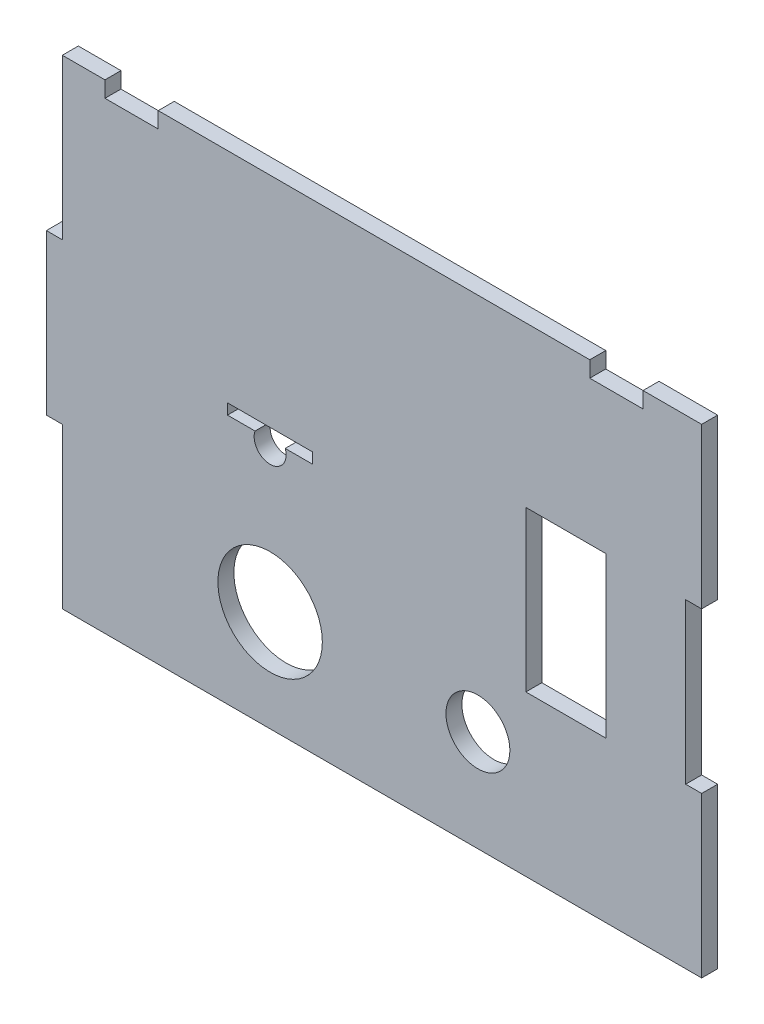
ISO-10303-21;
HEADER;
FILE_DESCRIPTION(('STEP AP214'),'2;1');
FILE_NAME('part.step','',(''),(''),'','','');
FILE_SCHEMA(('AUTOMOTIVE_DESIGN { 1 0 10303 214 1 1 1 1 }'));
ENDSEC;
DATA;
#1=APPLICATION_CONTEXT('core data for automotive mechanical design processes');
#2=APPLICATION_PROTOCOL_DEFINITION('international standard','automotive_design',2000,#1);
#3=PRODUCT_CONTEXT('',#1,'mechanical');
#4=PRODUCT('Part','Part','',(#3));
#5=PRODUCT_RELATED_PRODUCT_CATEGORY('part','',(#4));
#6=PRODUCT_DEFINITION_FORMATION('','',#4);
#7=PRODUCT_DEFINITION_CONTEXT('part definition',#1,'design');
#8=PRODUCT_DEFINITION('design','',#6,#7);
#9=PRODUCT_DEFINITION_SHAPE('','',#8);
#10=(LENGTH_UNIT() NAMED_UNIT(*) SI_UNIT(.MILLI.,.METRE.));
#11=(NAMED_UNIT(*) PLANE_ANGLE_UNIT() SI_UNIT($,.RADIAN.));
#12=(NAMED_UNIT(*) SI_UNIT($,.STERADIAN.) SOLID_ANGLE_UNIT());
#13=UNCERTAINTY_MEASURE_WITH_UNIT(LENGTH_MEASURE(1.E-05),#10,'distance_accuracy_value','');
#14=(GEOMETRIC_REPRESENTATION_CONTEXT(3) GLOBAL_UNCERTAINTY_ASSIGNED_CONTEXT((#13)) GLOBAL_UNIT_ASSIGNED_CONTEXT((#10,
#11,#12)) REPRESENTATION_CONTEXT('',''));
#15=CARTESIAN_POINT('',(0.,0.,0.));
#16=DIRECTION('',(0.,0.,1.));
#17=DIRECTION('',(1.,0.,0.));
#18=AXIS2_PLACEMENT_3D('',#15,#16,#17);
#19=CARTESIAN_POINT('',(0.,0.,3.));
#20=DIRECTION('',(0.,0.,1.));
#21=DIRECTION('',(1.,0.,0.));
#22=AXIS2_PLACEMENT_3D('',#19,#20,#21);
#23=PLANE('',#22);
#24=DIRECTION('',(-1.,0.,0.));
#25=VECTOR('',#24,1.);
#26=CARTESIAN_POINT('',(-175.191927583465,-27.0000000000001,3.));
#27=LINE('',#26,#25);
#28=CARTESIAN_POINT('',(-175.191927583465,-27.0000000000001,3.));
#29=VERTEX_POINT('',#28);
#30=CARTESIAN_POINT('',(-190.191927583465,-27.0000000000001,3.));
#31=VERTEX_POINT('',#30);
#32=EDGE_CURVE('E289',#29,#31,#27,.T.);
#33=ORIENTED_EDGE('',*,*,#32,.F.);
#34=DIRECTION('',(0.,1.,0.));
#35=VECTOR('',#34,1.);
#36=CARTESIAN_POINT('',(-175.191927583465,-57.0000000000001,3.));
#37=LINE('',#36,#35);
#38=CARTESIAN_POINT('',(-175.191927583465,-57.0000000000001,3.));
#39=VERTEX_POINT('',#38);
#40=EDGE_CURVE('E287',#39,#29,#37,.T.);
#41=ORIENTED_EDGE('',*,*,#40,.F.);
#42=DIRECTION('',(1.,0.,0.));
#43=VECTOR('',#42,1.);
#44=CARTESIAN_POINT('',(-175.191927583465,-57.0000000000001,3.));
#45=LINE('',#44,#43);
#46=CARTESIAN_POINT('',(-190.191927583465,-57.0000000000001,3.));
#47=VERTEX_POINT('',#46);
#48=EDGE_CURVE('E295',#47,#39,#45,.T.);
#49=ORIENTED_EDGE('',*,*,#48,.F.);
#50=DIRECTION('',(0.,-1.,0.));
#51=VECTOR('',#50,1.);
#52=CARTESIAN_POINT('',(-190.191927583465,-57.0000000000001,3.));
#53=LINE('',#52,#51);
#54=EDGE_CURVE('E292',#31,#47,#53,.T.);
#55=ORIENTED_EDGE('',*,*,#54,.F.);
#56=EDGE_LOOP('',(#33,#41,#49,#55));
#57=FACE_BOUND('',#56,.T.);
#58=CARTESIAN_POINT('',(-238.191927583464,-68.0000000000001,3.));
#59=DIRECTION('',(0.,0.,1.));
#60=DIRECTION('',(1.,0.,0.));
#61=AXIS2_PLACEMENT_3D('',#58,#59,#60);
#62=CIRCLE('',#61,9.79999999999999);
#63=CARTESIAN_POINT('',(-228.391927583464,-68.0000000000001,3.));
#64=VERTEX_POINT('',#63);
#65=EDGE_CURVE('E318',#64,#64,#62,.T.);
#66=ORIENTED_EDGE('',*,*,#65,.F.);
#67=EDGE_LOOP('',(#66));
#68=FACE_BOUND('',#67,.T.);
#69=DIRECTION('',(1.,0.,0.));
#70=VECTOR('',#69,1.);
#71=CARTESIAN_POINT('',(-157.191927583465,-27.0000000000001,3.));
#72=LINE('',#71,#70);
#73=CARTESIAN_POINT('',(-160.191927583465,-27.0000000000001,3.));
#74=VERTEX_POINT('',#73);
#75=CARTESIAN_POINT('',(-157.191927583465,-27.0000000000001,3.));
#76=VERTEX_POINT('',#75);
#77=EDGE_CURVE('E324',#74,#76,#72,.T.);
#78=ORIENTED_EDGE('',*,*,#77,.T.);
#79=DIRECTION('',(0.,1.,0.));
#80=VECTOR('',#79,1.);
#81=CARTESIAN_POINT('',(-157.191927583465,-27.0000000000001,3.));
#82=LINE('',#81,#80);
#83=CARTESIAN_POINT('',(-157.191927583465,3.,3.));
#84=VERTEX_POINT('',#83);
#85=EDGE_CURVE('E327',#76,#84,#82,.T.);
#86=ORIENTED_EDGE('',*,*,#85,.T.);
#87=DIRECTION('',(-1.,0.,0.));
#88=VECTOR('',#87,1.);
#89=CARTESIAN_POINT('',(-168.191927583465,3.,3.));
#90=LINE('',#89,#88);
#91=CARTESIAN_POINT('',(-168.191927583465,3.,3.));
#92=VERTEX_POINT('',#91);
#93=EDGE_CURVE('E330',#84,#92,#90,.T.);
#94=ORIENTED_EDGE('',*,*,#93,.T.);
#95=DIRECTION('',(0.,-1.,0.));
#96=VECTOR('',#95,1.);
#97=CARTESIAN_POINT('',(-168.191927583465,0.,3.));
#98=LINE('',#97,#96);
#99=CARTESIAN_POINT('',(-168.191927583465,0.,3.));
#100=VERTEX_POINT('',#99);
#101=EDGE_CURVE('E332',#92,#100,#98,.T.);
#102=ORIENTED_EDGE('',*,*,#101,.T.);
#103=DIRECTION('',(-1.,0.,0.));
#104=VECTOR('',#103,1.);
#105=CARTESIAN_POINT('',(-178.191927583465,0.,3.));
#106=LINE('',#105,#104);
#107=CARTESIAN_POINT('',(-178.191927583465,0.,3.));
#108=VERTEX_POINT('',#107);
#109=EDGE_CURVE('E334',#100,#108,#106,.T.);
#110=ORIENTED_EDGE('',*,*,#109,.T.);
#111=DIRECTION('',(0.,1.,0.));
#112=VECTOR('',#111,1.);
#113=CARTESIAN_POINT('',(-178.191927583465,3.,3.));
#114=LINE('',#113,#112);
#115=CARTESIAN_POINT('',(-178.191927583465,3.,3.));
#116=VERTEX_POINT('',#115);
#117=EDGE_CURVE('E336',#108,#116,#114,.T.);
#118=ORIENTED_EDGE('',*,*,#117,.T.);
#119=DIRECTION('',(-1.,0.,0.));
#120=VECTOR('',#119,1.);
#121=CARTESIAN_POINT('',(-259.191927583465,3.,3.));
#122=LINE('',#121,#120);
#123=CARTESIAN_POINT('',(-259.191927583465,3.,3.));
#124=VERTEX_POINT('',#123);
#125=EDGE_CURVE('E338',#116,#124,#122,.T.);
#126=ORIENTED_EDGE('',*,*,#125,.T.);
#127=DIRECTION('',(0.,-1.,0.));
#128=VECTOR('',#127,1.);
#129=CARTESIAN_POINT('',(-259.191927583465,0.,3.));
#130=LINE('',#129,#128);
#131=CARTESIAN_POINT('',(-259.191927583465,0.,3.));
#132=VERTEX_POINT('',#131);
#133=EDGE_CURVE('E340',#124,#132,#130,.T.);
#134=ORIENTED_EDGE('',*,*,#133,.T.);
#135=DIRECTION('',(-1.,0.,0.));
#136=VECTOR('',#135,1.);
#137=CARTESIAN_POINT('',(-269.191927583465,0.,3.));
#138=LINE('',#137,#136);
#139=CARTESIAN_POINT('',(-269.191927583465,0.,3.));
#140=VERTEX_POINT('',#139);
#141=EDGE_CURVE('E342',#132,#140,#138,.T.);
#142=ORIENTED_EDGE('',*,*,#141,.T.);
#143=DIRECTION('',(0.,1.,0.));
#144=VECTOR('',#143,1.);
#145=CARTESIAN_POINT('',(-269.191927583465,3.,3.));
#146=LINE('',#145,#144);
#147=CARTESIAN_POINT('',(-269.191927583465,3.,3.));
#148=VERTEX_POINT('',#147);
#149=EDGE_CURVE('E344',#140,#148,#146,.T.);
#150=ORIENTED_EDGE('',*,*,#149,.T.);
#151=DIRECTION('',(-1.,0.,0.));
#152=VECTOR('',#151,1.);
#153=CARTESIAN_POINT('',(-277.191927583465,3.,3.));
#154=LINE('',#153,#152);
#155=CARTESIAN_POINT('',(-277.191927583465,3.,3.));
#156=VERTEX_POINT('',#155);
#157=EDGE_CURVE('E346',#148,#156,#154,.T.);
#158=ORIENTED_EDGE('',*,*,#157,.T.);
#159=DIRECTION('',(0.,-1.,0.));
#160=VECTOR('',#159,1.);
#161=CARTESIAN_POINT('',(-277.191927583465,-27.0000000000001,3.));
#162=LINE('',#161,#160);
#163=CARTESIAN_POINT('',(-277.191927583465,-27.0000000000001,3.));
#164=VERTEX_POINT('',#163);
#165=EDGE_CURVE('E348',#156,#164,#162,.T.);
#166=ORIENTED_EDGE('',*,*,#165,.T.);
#167=DIRECTION('',(-1.,0.,0.));
#168=VECTOR('',#167,1.);
#169=CARTESIAN_POINT('',(-280.191927583465,-27.0000000000001,3.));
#170=LINE('',#169,#168);
#171=CARTESIAN_POINT('',(-280.191927583465,-27.0000000000001,3.));
#172=VERTEX_POINT('',#171);
#173=EDGE_CURVE('E350',#164,#172,#170,.T.);
#174=ORIENTED_EDGE('',*,*,#173,.T.);
#175=DIRECTION('',(0.,-1.,0.));
#176=VECTOR('',#175,1.);
#177=CARTESIAN_POINT('',(-280.191927583465,-57.0000000000001,3.));
#178=LINE('',#177,#176);
#179=CARTESIAN_POINT('',(-280.191927583465,-57.0000000000001,3.));
#180=VERTEX_POINT('',#179);
#181=EDGE_CURVE('E352',#172,#180,#178,.T.);
#182=ORIENTED_EDGE('',*,*,#181,.T.);
#183=DIRECTION('',(1.,0.,0.));
#184=VECTOR('',#183,1.);
#185=CARTESIAN_POINT('',(-277.191927583465,-57.0000000000001,3.));
#186=LINE('',#185,#184);
#187=CARTESIAN_POINT('',(-277.191927583465,-57.0000000000001,3.));
#188=VERTEX_POINT('',#187);
#189=EDGE_CURVE('E354',#180,#188,#186,.T.);
#190=ORIENTED_EDGE('',*,*,#189,.T.);
#191=DIRECTION('',(0.,-1.,0.));
#192=VECTOR('',#191,1.);
#193=CARTESIAN_POINT('',(-277.191927583464,-87.0000000000001,3.));
#194=LINE('',#193,#192);
#195=CARTESIAN_POINT('',(-277.191927583464,-87.0000000000001,3.));
#196=VERTEX_POINT('',#195);
#197=EDGE_CURVE('E356',#188,#196,#194,.T.);
#198=ORIENTED_EDGE('',*,*,#197,.T.);
#199=DIRECTION('',(1.,0.,0.));
#200=VECTOR('',#199,1.);
#201=CARTESIAN_POINT('',(-157.191927583464,-87.0000000000001,3.));
#202=LINE('',#201,#200);
#203=CARTESIAN_POINT('',(-157.191927583464,-87.0000000000001,3.));
#204=VERTEX_POINT('',#203);
#205=EDGE_CURVE('E358',#196,#204,#202,.T.);
#206=ORIENTED_EDGE('',*,*,#205,.T.);
#207=DIRECTION('',(0.,1.,0.));
#208=VECTOR('',#207,1.);
#209=CARTESIAN_POINT('',(-157.191927583465,-57.0000000000001,3.));
#210=LINE('',#209,#208);
#211=CARTESIAN_POINT('',(-157.191927583465,-57.0000000000001,3.));
#212=VERTEX_POINT('',#211);
#213=EDGE_CURVE('E360',#204,#212,#210,.T.);
#214=ORIENTED_EDGE('',*,*,#213,.T.);
#215=DIRECTION('',(-1.,0.,0.));
#216=VECTOR('',#215,1.);
#217=CARTESIAN_POINT('',(-160.191927583465,-57.0000000000001,3.));
#218=LINE('',#217,#216);
#219=CARTESIAN_POINT('',(-160.191927583465,-57.0000000000001,3.));
#220=VERTEX_POINT('',#219);
#221=EDGE_CURVE('E362',#212,#220,#218,.T.);
#222=ORIENTED_EDGE('',*,*,#221,.T.);
#223=DIRECTION('',(0.,1.,0.));
#224=VECTOR('',#223,1.);
#225=CARTESIAN_POINT('',(-160.191927583465,-27.0000000000001,3.));
#226=LINE('',#225,#224);
#227=EDGE_CURVE('E364',#220,#74,#226,.T.);
#228=ORIENTED_EDGE('',*,*,#227,.T.);
#229=EDGE_LOOP('',(#78,#86,#94,#102,#110,#118,#126,#134,#142,#150,#158,#166,#174,#182,#190,#198,
#206,#214,#222,#228));
#230=FACE_BOUND('',#229,.T.);
#231=CARTESIAN_POINT('',(-199.191927583464,-68.,3.));
#232=DIRECTION('',(0.,0.,1.));
#233=DIRECTION('',(1.,0.,0.));
#234=AXIS2_PLACEMENT_3D('',#231,#232,#233);
#235=CIRCLE('',#234,6.00000000000002);
#236=CARTESIAN_POINT('',(-193.191927583464,-68.,3.));
#237=VERTEX_POINT('',#236);
#238=EDGE_CURVE('E281',#237,#237,#235,.T.);
#239=ORIENTED_EDGE('',*,*,#238,.F.);
#240=EDGE_LOOP('',(#239));
#241=FACE_BOUND('',#240,.T.);
#242=DIRECTION('',(1.,0.,0.));
#243=VECTOR('',#242,1.);
#244=CARTESIAN_POINT('',(-246.191927583464,-40.0000000000001,3.));
#245=LINE('',#244,#243);
#246=CARTESIAN_POINT('',(-246.191927583464,-40.0000000000001,3.));
#247=VERTEX_POINT('',#246);
#248=CARTESIAN_POINT('',(-241.020354708211,-40.0000000000001,3.));
#249=VERTEX_POINT('',#248);
#250=EDGE_CURVE('E238',#247,#249,#245,.T.);
#251=ORIENTED_EDGE('',*,*,#250,.F.);
#252=DIRECTION('',(0.,-1.,0.));
#253=VECTOR('',#252,1.);
#254=CARTESIAN_POINT('',(-246.191927583464,-40.0000000000001,3.));
#255=LINE('',#254,#253);
#256=CARTESIAN_POINT('',(-246.191927583464,-38.0000000000001,3.));
#257=VERTEX_POINT('',#256);
#258=EDGE_CURVE('E230',#257,#247,#255,.T.);
#259=ORIENTED_EDGE('',*,*,#258,.F.);
#260=DIRECTION('',(-1.,0.,0.));
#261=VECTOR('',#260,1.);
#262=CARTESIAN_POINT('',(-246.191927583464,-38.0000000000001,3.));
#263=LINE('',#262,#261);
#264=CARTESIAN_POINT('',(-230.191927583464,-38.0000000000001,3.));
#265=VERTEX_POINT('',#264);
#266=EDGE_CURVE('E259',#265,#257,#263,.T.);
#267=ORIENTED_EDGE('',*,*,#266,.F.);
#268=DIRECTION('',(0.,1.,0.));
#269=VECTOR('',#268,1.);
#270=CARTESIAN_POINT('',(-230.191927583464,-40.0000000000001,3.));
#271=LINE('',#270,#269);
#272=CARTESIAN_POINT('',(-230.191927583464,-40.0000000000001,3.));
#273=VERTEX_POINT('',#272);
#274=EDGE_CURVE('E257',#273,#265,#271,.T.);
#275=ORIENTED_EDGE('',*,*,#274,.F.);
#276=DIRECTION('',(1.,0.,0.));
#277=VECTOR('',#276,1.);
#278=CARTESIAN_POINT('',(-235.363500458718,-40.0000000000001,3.));
#279=LINE('',#278,#277);
#280=CARTESIAN_POINT('',(-235.363500458718,-40.0000000000001,3.));
#281=VERTEX_POINT('',#280);
#282=EDGE_CURVE('E253',#281,#273,#279,.T.);
#283=ORIENTED_EDGE('',*,*,#282,.F.);
#284=CARTESIAN_POINT('',(-238.191927583464,-41.0000000000001,3.));
#285=DIRECTION('',(0.,0.,1.));
#286=DIRECTION('',(1.,0.,0.));
#287=AXIS2_PLACEMENT_3D('',#284,#285,#286);
#288=CIRCLE('',#287,2.99999999999995);
#289=EDGE_CURVE('E251',#249,#281,#288,.T.);
#290=ORIENTED_EDGE('',*,*,#289,.F.);
#291=EDGE_LOOP('',(#251,#259,#267,#275,#283,#290));
#292=FACE_BOUND('',#291,.T.);
#293=ADVANCED_FACE('F33',(#57,#68,#230,#241,#292),#23,.T.);
#294=CARTESIAN_POINT('',(0.,0.,0.));
#295=DIRECTION('',(0.,0.,1.));
#296=DIRECTION('',(1.,0.,0.));
#297=AXIS2_PLACEMENT_3D('',#294,#295,#296);
#298=PLANE('',#297);
#299=CARTESIAN_POINT('',(-199.191927583464,-68.,0.));
#300=DIRECTION('',(0.,0.,1.));
#301=DIRECTION('',(1.,0.,0.));
#302=AXIS2_PLACEMENT_3D('',#299,#300,#301);
#303=CIRCLE('',#302,6.00000000000002);
#304=CARTESIAN_POINT('',(-193.191927583464,-68.,0.));
#305=VERTEX_POINT('',#304);
#306=EDGE_CURVE('E246',#305,#305,#303,.T.);
#307=ORIENTED_EDGE('',*,*,#306,.T.);
#308=EDGE_LOOP('',(#307));
#309=FACE_BOUND('',#308,.T.);
#310=DIRECTION('',(0.,1.,0.));
#311=VECTOR('',#310,1.);
#312=CARTESIAN_POINT('',(-175.191927583465,-57.0000000000001,0.));
#313=LINE('',#312,#311);
#314=CARTESIAN_POINT('',(-175.191927583465,-57.0000000000001,0.));
#315=VERTEX_POINT('',#314);
#316=CARTESIAN_POINT('',(-175.191927583465,-27.0000000000001,0.));
#317=VERTEX_POINT('',#316);
#318=EDGE_CURVE('E284',#315,#317,#313,.T.);
#319=ORIENTED_EDGE('',*,*,#318,.T.);
#320=DIRECTION('',(-1.,0.,0.));
#321=VECTOR('',#320,1.);
#322=CARTESIAN_POINT('',(-175.191927583465,-27.0000000000001,0.));
#323=LINE('',#322,#321);
#324=CARTESIAN_POINT('',(-190.191927583465,-27.0000000000001,0.));
#325=VERTEX_POINT('',#324);
#326=EDGE_CURVE('E300',#317,#325,#323,.T.);
#327=ORIENTED_EDGE('',*,*,#326,.T.);
#328=DIRECTION('',(0.,-1.,0.));
#329=VECTOR('',#328,1.);
#330=CARTESIAN_POINT('',(-190.191927583465,-57.0000000000001,0.));
#331=LINE('',#330,#329);
#332=CARTESIAN_POINT('',(-190.191927583465,-57.0000000000001,0.));
#333=VERTEX_POINT('',#332);
#334=EDGE_CURVE('E303',#325,#333,#331,.T.);
#335=ORIENTED_EDGE('',*,*,#334,.T.);
#336=DIRECTION('',(1.,0.,0.));
#337=VECTOR('',#336,1.);
#338=CARTESIAN_POINT('',(-175.191927583465,-57.0000000000001,0.));
#339=LINE('',#338,#337);
#340=EDGE_CURVE('E290',#333,#315,#339,.T.);
#341=ORIENTED_EDGE('',*,*,#340,.T.);
#342=EDGE_LOOP('',(#319,#327,#335,#341));
#343=FACE_BOUND('',#342,.T.);
#344=DIRECTION('',(1.,0.,0.));
#345=VECTOR('',#344,1.);
#346=CARTESIAN_POINT('',(-157.191927583465,-27.0000000000001,0.));
#347=LINE('',#346,#345);
#348=CARTESIAN_POINT('',(-160.191927583465,-27.0000000000001,0.));
#349=VERTEX_POINT('',#348);
#350=CARTESIAN_POINT('',(-157.191927583465,-27.0000000000001,0.));
#351=VERTEX_POINT('',#350);
#352=EDGE_CURVE('E321',#349,#351,#347,.T.);
#353=ORIENTED_EDGE('',*,*,#352,.F.);
#354=DIRECTION('',(0.,1.,0.));
#355=VECTOR('',#354,1.);
#356=CARTESIAN_POINT('',(-160.191927583465,-27.0000000000001,0.));
#357=LINE('',#356,#355);
#358=CARTESIAN_POINT('',(-160.191927583465,-57.0000000000001,0.));
#359=VERTEX_POINT('',#358);
#360=EDGE_CURVE('E328',#359,#349,#357,.T.);
#361=ORIENTED_EDGE('',*,*,#360,.F.);
#362=DIRECTION('',(-1.,0.,0.));
#363=VECTOR('',#362,1.);
#364=CARTESIAN_POINT('',(-160.191927583465,-57.0000000000001,0.));
#365=LINE('',#364,#363);
#366=CARTESIAN_POINT('',(-157.191927583465,-57.0000000000001,0.));
#367=VERTEX_POINT('',#366);
#368=EDGE_CURVE('E403',#367,#359,#365,.T.);
#369=ORIENTED_EDGE('',*,*,#368,.F.);
#370=DIRECTION('',(0.,1.,0.));
#371=VECTOR('',#370,1.);
#372=CARTESIAN_POINT('',(-157.191927583465,-57.0000000000001,0.));
#373=LINE('',#372,#371);
#374=CARTESIAN_POINT('',(-157.191927583464,-87.0000000000001,0.));
#375=VERTEX_POINT('',#374);
#376=EDGE_CURVE('E401',#375,#367,#373,.T.);
#377=ORIENTED_EDGE('',*,*,#376,.F.);
#378=DIRECTION('',(1.,0.,0.));
#379=VECTOR('',#378,1.);
#380=CARTESIAN_POINT('',(-157.191927583464,-87.0000000000001,0.));
#381=LINE('',#380,#379);
#382=CARTESIAN_POINT('',(-277.191927583464,-87.0000000000001,0.));
#383=VERTEX_POINT('',#382);
#384=EDGE_CURVE('E399',#383,#375,#381,.T.);
#385=ORIENTED_EDGE('',*,*,#384,.F.);
#386=DIRECTION('',(0.,-1.,0.));
#387=VECTOR('',#386,1.);
#388=CARTESIAN_POINT('',(-277.191927583464,-87.0000000000001,0.));
#389=LINE('',#388,#387);
#390=CARTESIAN_POINT('',(-277.191927583465,-57.0000000000001,0.));
#391=VERTEX_POINT('',#390);
#392=EDGE_CURVE('E397',#391,#383,#389,.T.);
#393=ORIENTED_EDGE('',*,*,#392,.F.);
#394=DIRECTION('',(1.,0.,0.));
#395=VECTOR('',#394,1.);
#396=CARTESIAN_POINT('',(-277.191927583465,-57.0000000000001,0.));
#397=LINE('',#396,#395);
#398=CARTESIAN_POINT('',(-280.191927583465,-57.0000000000001,0.));
#399=VERTEX_POINT('',#398);
#400=EDGE_CURVE('E395',#399,#391,#397,.T.);
#401=ORIENTED_EDGE('',*,*,#400,.F.);
#402=DIRECTION('',(0.,-1.,0.));
#403=VECTOR('',#402,1.);
#404=CARTESIAN_POINT('',(-280.191927583465,-57.0000000000001,0.));
#405=LINE('',#404,#403);
#406=CARTESIAN_POINT('',(-280.191927583465,-27.0000000000001,0.));
#407=VERTEX_POINT('',#406);
#408=EDGE_CURVE('E393',#407,#399,#405,.T.);
#409=ORIENTED_EDGE('',*,*,#408,.F.);
#410=DIRECTION('',(-1.,0.,0.));
#411=VECTOR('',#410,1.);
#412=CARTESIAN_POINT('',(-280.191927583465,-27.0000000000001,0.));
#413=LINE('',#412,#411);
#414=CARTESIAN_POINT('',(-277.191927583465,-27.0000000000001,0.));
#415=VERTEX_POINT('',#414);
#416=EDGE_CURVE('E391',#415,#407,#413,.T.);
#417=ORIENTED_EDGE('',*,*,#416,.F.);
#418=DIRECTION('',(0.,-1.,0.));
#419=VECTOR('',#418,1.);
#420=CARTESIAN_POINT('',(-277.191927583465,-27.0000000000001,0.));
#421=LINE('',#420,#419);
#422=CARTESIAN_POINT('',(-277.191927583465,3.,0.));
#423=VERTEX_POINT('',#422);
#424=EDGE_CURVE('E389',#423,#415,#421,.T.);
#425=ORIENTED_EDGE('',*,*,#424,.F.);
#426=DIRECTION('',(-1.,0.,0.));
#427=VECTOR('',#426,1.);
#428=CARTESIAN_POINT('',(-277.191927583465,3.,0.));
#429=LINE('',#428,#427);
#430=CARTESIAN_POINT('',(-269.191927583465,3.,0.));
#431=VERTEX_POINT('',#430);
#432=EDGE_CURVE('E387',#431,#423,#429,.T.);
#433=ORIENTED_EDGE('',*,*,#432,.F.);
#434=DIRECTION('',(0.,1.,0.));
#435=VECTOR('',#434,1.);
#436=CARTESIAN_POINT('',(-269.191927583465,3.,0.));
#437=LINE('',#436,#435);
#438=CARTESIAN_POINT('',(-269.191927583465,0.,0.));
#439=VERTEX_POINT('',#438);
#440=EDGE_CURVE('E385',#439,#431,#437,.T.);
#441=ORIENTED_EDGE('',*,*,#440,.F.);
#442=DIRECTION('',(-1.,0.,0.));
#443=VECTOR('',#442,1.);
#444=CARTESIAN_POINT('',(-269.191927583465,0.,0.));
#445=LINE('',#444,#443);
#446=CARTESIAN_POINT('',(-259.191927583465,0.,0.));
#447=VERTEX_POINT('',#446);
#448=EDGE_CURVE('E383',#447,#439,#445,.T.);
#449=ORIENTED_EDGE('',*,*,#448,.F.);
#450=DIRECTION('',(0.,-1.,0.));
#451=VECTOR('',#450,1.);
#452=CARTESIAN_POINT('',(-259.191927583465,0.,0.));
#453=LINE('',#452,#451);
#454=CARTESIAN_POINT('',(-259.191927583465,3.,0.));
#455=VERTEX_POINT('',#454);
#456=EDGE_CURVE('E381',#455,#447,#453,.T.);
#457=ORIENTED_EDGE('',*,*,#456,.F.);
#458=DIRECTION('',(-1.,0.,0.));
#459=VECTOR('',#458,1.);
#460=CARTESIAN_POINT('',(-259.191927583465,3.,0.));
#461=LINE('',#460,#459);
#462=CARTESIAN_POINT('',(-178.191927583465,3.,0.));
#463=VERTEX_POINT('',#462);
#464=EDGE_CURVE('E379',#463,#455,#461,.T.);
#465=ORIENTED_EDGE('',*,*,#464,.F.);
#466=DIRECTION('',(0.,1.,0.));
#467=VECTOR('',#466,1.);
#468=CARTESIAN_POINT('',(-178.191927583465,3.,0.));
#469=LINE('',#468,#467);
#470=CARTESIAN_POINT('',(-178.191927583465,0.,0.));
#471=VERTEX_POINT('',#470);
#472=EDGE_CURVE('E377',#471,#463,#469,.T.);
#473=ORIENTED_EDGE('',*,*,#472,.F.);
#474=DIRECTION('',(-1.,0.,0.));
#475=VECTOR('',#474,1.);
#476=CARTESIAN_POINT('',(-178.191927583465,0.,0.));
#477=LINE('',#476,#475);
#478=CARTESIAN_POINT('',(-168.191927583465,0.,0.));
#479=VERTEX_POINT('',#478);
#480=EDGE_CURVE('E375',#479,#471,#477,.T.);
#481=ORIENTED_EDGE('',*,*,#480,.F.);
#482=DIRECTION('',(0.,-1.,0.));
#483=VECTOR('',#482,1.);
#484=CARTESIAN_POINT('',(-168.191927583465,0.,0.));
#485=LINE('',#484,#483);
#486=CARTESIAN_POINT('',(-168.191927583465,3.,0.));
#487=VERTEX_POINT('',#486);
#488=EDGE_CURVE('E373',#487,#479,#485,.T.);
#489=ORIENTED_EDGE('',*,*,#488,.F.);
#490=DIRECTION('',(-1.,0.,0.));
#491=VECTOR('',#490,1.);
#492=CARTESIAN_POINT('',(-168.191927583465,3.,0.));
#493=LINE('',#492,#491);
#494=CARTESIAN_POINT('',(-157.191927583465,3.,0.));
#495=VERTEX_POINT('',#494);
#496=EDGE_CURVE('E371',#495,#487,#493,.T.);
#497=ORIENTED_EDGE('',*,*,#496,.F.);
#498=DIRECTION('',(0.,1.,0.));
#499=VECTOR('',#498,1.);
#500=CARTESIAN_POINT('',(-157.191927583465,-27.0000000000001,0.));
#501=LINE('',#500,#499);
#502=EDGE_CURVE('E369',#351,#495,#501,.T.);
#503=ORIENTED_EDGE('',*,*,#502,.F.);
#504=EDGE_LOOP('',(#353,#361,#369,#377,#385,#393,#401,#409,#417,#425,#433,#441,#449,#457,#465,
#473,#481,#489,#497,#503));
#505=FACE_BOUND('',#504,.T.);
#506=CARTESIAN_POINT('',(-238.191927583464,-68.0000000000001,0.));
#507=DIRECTION('',(0.,0.,1.));
#508=DIRECTION('',(1.,0.,0.));
#509=AXIS2_PLACEMENT_3D('',#506,#507,#508);
#510=CIRCLE('',#509,9.79999999999999);
#511=CARTESIAN_POINT('',(-228.391927583464,-68.0000000000001,0.));
#512=VERTEX_POINT('',#511);
#513=EDGE_CURVE('E317',#512,#512,#510,.T.);
#514=ORIENTED_EDGE('',*,*,#513,.T.);
#515=EDGE_LOOP('',(#514));
#516=FACE_BOUND('',#515,.T.);
#517=DIRECTION('',(0.,-1.,0.));
#518=VECTOR('',#517,1.);
#519=CARTESIAN_POINT('',(-246.191927583464,-40.0000000000001,0.));
#520=LINE('',#519,#518);
#521=CARTESIAN_POINT('',(-246.191927583464,-38.0000000000001,0.));
#522=VERTEX_POINT('',#521);
#523=CARTESIAN_POINT('',(-246.191927583464,-40.0000000000001,0.));
#524=VERTEX_POINT('',#523);
#525=EDGE_CURVE('E56',#522,#524,#520,.T.);
#526=ORIENTED_EDGE('',*,*,#525,.T.);
#527=DIRECTION('',(1.,0.,0.));
#528=VECTOR('',#527,1.);
#529=CARTESIAN_POINT('',(-246.191927583464,-40.0000000000001,0.));
#530=LINE('',#529,#528);
#531=CARTESIAN_POINT('',(-241.020354708211,-40.0000000000001,0.));
#532=VERTEX_POINT('',#531);
#533=EDGE_CURVE('E245',#524,#532,#530,.T.);
#534=ORIENTED_EDGE('',*,*,#533,.T.);
#535=CARTESIAN_POINT('',(-238.191927583464,-41.0000000000001,0.));
#536=DIRECTION('',(0.,0.,1.));
#537=DIRECTION('',(1.,0.,0.));
#538=AXIS2_PLACEMENT_3D('',#535,#536,#537);
#539=CIRCLE('',#538,2.99999999999995);
#540=CARTESIAN_POINT('',(-235.363500458718,-40.0000000000001,0.));
#541=VERTEX_POINT('',#540);
#542=EDGE_CURVE('E263',#532,#541,#539,.T.);
#543=ORIENTED_EDGE('',*,*,#542,.T.);
#544=DIRECTION('',(1.,0.,0.));
#545=VECTOR('',#544,1.);
#546=CARTESIAN_POINT('',(-235.363500458718,-40.0000000000001,0.));
#547=LINE('',#546,#545);
#548=CARTESIAN_POINT('',(-230.191927583464,-40.0000000000001,0.));
#549=VERTEX_POINT('',#548);
#550=EDGE_CURVE('E266',#541,#549,#547,.T.);
#551=ORIENTED_EDGE('',*,*,#550,.T.);
#552=DIRECTION('',(0.,1.,0.));
#553=VECTOR('',#552,1.);
#554=CARTESIAN_POINT('',(-230.191927583464,-40.0000000000001,0.));
#555=LINE('',#554,#553);
#556=CARTESIAN_POINT('',(-230.191927583464,-38.0000000000001,0.));
#557=VERTEX_POINT('',#556);
#558=EDGE_CURVE('E269',#549,#557,#555,.T.);
#559=ORIENTED_EDGE('',*,*,#558,.T.);
#560=DIRECTION('',(-1.,0.,0.));
#561=VECTOR('',#560,1.);
#562=CARTESIAN_POINT('',(-246.191927583464,-38.0000000000001,0.));
#563=LINE('',#562,#561);
#564=EDGE_CURVE('E239',#557,#522,#563,.T.);
#565=ORIENTED_EDGE('',*,*,#564,.T.);
#566=EDGE_LOOP('',(#526,#534,#543,#551,#559,#565));
#567=FACE_BOUND('',#566,.T.);
#568=ADVANCED_FACE('F469',(#309,#343,#505,#516,#567),#298,.F.);
#569=CARTESIAN_POINT('',(-157.191927583465,-27.0000000000001,3.));
#570=DIRECTION('',(0.,1.,0.));
#571=DIRECTION('',(0.,0.,1.));
#572=AXIS2_PLACEMENT_3D('',#569,#570,#571);
#573=PLANE('',#572);
#574=ORIENTED_EDGE('',*,*,#352,.T.);
#575=DIRECTION('',(0.,0.,-1.));
#576=VECTOR('',#575,1.);
#577=CARTESIAN_POINT('',(-157.191927583465,-27.0000000000001,3.));
#578=LINE('',#577,#576);
#579=EDGE_CURVE('E11',#76,#351,#578,.T.);
#580=ORIENTED_EDGE('',*,*,#579,.F.);
#581=ORIENTED_EDGE('',*,*,#77,.F.);
#582=DIRECTION('',(0.,0.,-1.));
#583=VECTOR('',#582,1.);
#584=CARTESIAN_POINT('',(-160.191927583465,-27.0000000000001,3.));
#585=LINE('',#584,#583);
#586=EDGE_CURVE('E366',#74,#349,#585,.T.);
#587=ORIENTED_EDGE('',*,*,#586,.T.);
#588=EDGE_LOOP('',(#574,#580,#581,#587));
#589=FACE_BOUND('',#588,.T.);
#590=ADVANCED_FACE('F35',(#589),#573,.F.);
#591=CARTESIAN_POINT('',(-157.191927583465,-27.0000000000001,3.));
#592=DIRECTION('',(-1.,0.,0.));
#593=DIRECTION('',(0.,0.,1.));
#594=AXIS2_PLACEMENT_3D('',#591,#592,#593);
#595=PLANE('',#594);
#596=ORIENTED_EDGE('',*,*,#502,.T.);
#597=DIRECTION('',(0.,0.,-1.));
#598=VECTOR('',#597,1.);
#599=CARTESIAN_POINT('',(-157.191927583465,3.,3.));
#600=LINE('',#599,#598);
#601=EDGE_CURVE('E41',#84,#495,#600,.T.);
#602=ORIENTED_EDGE('',*,*,#601,.F.);
#603=ORIENTED_EDGE('',*,*,#85,.F.);
#604=ORIENTED_EDGE('',*,*,#579,.T.);
#605=EDGE_LOOP('',(#596,#602,#603,#604));
#606=FACE_BOUND('',#605,.T.);
#607=ADVANCED_FACE('F487',(#606),#595,.F.);
#608=CARTESIAN_POINT('',(-168.191927583465,3.,3.));
#609=DIRECTION('',(0.,-1.,0.));
#610=DIRECTION('',(0.,0.,-1.));
#611=AXIS2_PLACEMENT_3D('',#608,#609,#610);
#612=PLANE('',#611);
#613=ORIENTED_EDGE('',*,*,#496,.T.);
#614=DIRECTION('',(0.,0.,-1.));
#615=VECTOR('',#614,1.);
#616=CARTESIAN_POINT('',(-168.191927583465,3.,3.));
#617=LINE('',#616,#615);
#618=EDGE_CURVE('E456',#92,#487,#617,.T.);
#619=ORIENTED_EDGE('',*,*,#618,.F.);
#620=ORIENTED_EDGE('',*,*,#93,.F.);
#621=ORIENTED_EDGE('',*,*,#601,.T.);
#622=EDGE_LOOP('',(#613,#619,#620,#621));
#623=FACE_BOUND('',#622,.T.);
#624=ADVANCED_FACE('F463',(#623),#612,.F.);
#625=CARTESIAN_POINT('',(-168.191927583465,0.,3.));
#626=DIRECTION('',(1.,0.,0.));
#627=DIRECTION('',(0.,0.,-1.));
#628=AXIS2_PLACEMENT_3D('',#625,#626,#627);
#629=PLANE('',#628);
#630=ORIENTED_EDGE('',*,*,#488,.T.);
#631=DIRECTION('',(0.,0.,-1.));
#632=VECTOR('',#631,1.);
#633=CARTESIAN_POINT('',(-168.191927583465,0.,3.));
#634=LINE('',#633,#632);
#635=EDGE_CURVE('E453',#100,#479,#634,.T.);
#636=ORIENTED_EDGE('',*,*,#635,.F.);
#637=ORIENTED_EDGE('',*,*,#101,.F.);
#638=ORIENTED_EDGE('',*,*,#618,.T.);
#639=EDGE_LOOP('',(#630,#636,#637,#638));
#640=FACE_BOUND('',#639,.T.);
#641=ADVANCED_FACE('F475',(#640),#629,.F.);
#642=CARTESIAN_POINT('',(-178.191927583465,0.,3.));
#643=DIRECTION('',(0.,-1.,0.));
#644=DIRECTION('',(0.,0.,-1.));
#645=AXIS2_PLACEMENT_3D('',#642,#643,#644);
#646=PLANE('',#645);
#647=ORIENTED_EDGE('',*,*,#480,.T.);
#648=DIRECTION('',(0.,0.,-1.));
#649=VECTOR('',#648,1.);
#650=CARTESIAN_POINT('',(-178.191927583465,0.,3.));
#651=LINE('',#650,#649);
#652=EDGE_CURVE('E450',#108,#471,#651,.T.);
#653=ORIENTED_EDGE('',*,*,#652,.F.);
#654=ORIENTED_EDGE('',*,*,#109,.F.);
#655=ORIENTED_EDGE('',*,*,#635,.T.);
#656=EDGE_LOOP('',(#647,#653,#654,#655));
#657=FACE_BOUND('',#656,.T.);
#658=ADVANCED_FACE('F479',(#657),#646,.F.);
#659=CARTESIAN_POINT('',(-178.191927583465,3.,3.));
#660=DIRECTION('',(-1.,0.,0.));
#661=DIRECTION('',(0.,0.,1.));
#662=AXIS2_PLACEMENT_3D('',#659,#660,#661);
#663=PLANE('',#662);
#664=ORIENTED_EDGE('',*,*,#472,.T.);
#665=DIRECTION('',(0.,0.,-1.));
#666=VECTOR('',#665,1.);
#667=CARTESIAN_POINT('',(-178.191927583465,3.,3.));
#668=LINE('',#667,#666);
#669=EDGE_CURVE('E447',#116,#463,#668,.T.);
#670=ORIENTED_EDGE('',*,*,#669,.F.);
#671=ORIENTED_EDGE('',*,*,#117,.F.);
#672=ORIENTED_EDGE('',*,*,#652,.T.);
#673=EDGE_LOOP('',(#664,#670,#671,#672));
#674=FACE_BOUND('',#673,.T.);
#675=ADVANCED_FACE('F560',(#674),#663,.F.);
#676=CARTESIAN_POINT('',(-259.191927583465,3.,3.));
#677=DIRECTION('',(0.,-1.,0.));
#678=DIRECTION('',(1.,0.,0.));
#679=AXIS2_PLACEMENT_3D('',#676,#677,#678);
#680=PLANE('',#679);
#681=ORIENTED_EDGE('',*,*,#464,.T.);
#682=DIRECTION('',(0.,0.,-1.));
#683=VECTOR('',#682,1.);
#684=CARTESIAN_POINT('',(-259.191927583465,3.,3.));
#685=LINE('',#684,#683);
#686=EDGE_CURVE('E444',#124,#455,#685,.T.);
#687=ORIENTED_EDGE('',*,*,#686,.F.);
#688=ORIENTED_EDGE('',*,*,#125,.F.);
#689=ORIENTED_EDGE('',*,*,#669,.T.);
#690=EDGE_LOOP('',(#681,#687,#688,#689));
#691=FACE_BOUND('',#690,.T.);
#692=ADVANCED_FACE('F558',(#691),#680,.F.);
#693=CARTESIAN_POINT('',(-259.191927583465,0.,3.));
#694=DIRECTION('',(1.,0.,0.));
#695=DIRECTION('',(0.,0.,-1.));
#696=AXIS2_PLACEMENT_3D('',#693,#694,#695);
#697=PLANE('',#696);
#698=ORIENTED_EDGE('',*,*,#456,.T.);
#699=DIRECTION('',(0.,0.,-1.));
#700=VECTOR('',#699,1.);
#701=CARTESIAN_POINT('',(-259.191927583465,0.,3.));
#702=LINE('',#701,#700);
#703=EDGE_CURVE('E441',#132,#447,#702,.T.);
#704=ORIENTED_EDGE('',*,*,#703,.F.);
#705=ORIENTED_EDGE('',*,*,#133,.F.);
#706=ORIENTED_EDGE('',*,*,#686,.T.);
#707=EDGE_LOOP('',(#698,#704,#705,#706));
#708=FACE_BOUND('',#707,.T.);
#709=ADVANCED_FACE('F553',(#708),#697,.F.);
#710=CARTESIAN_POINT('',(-269.191927583465,0.,3.));
#711=DIRECTION('',(0.,-1.,0.));
#712=DIRECTION('',(0.,0.,-1.));
#713=AXIS2_PLACEMENT_3D('',#710,#711,#712);
#714=PLANE('',#713);
#715=ORIENTED_EDGE('',*,*,#448,.T.);
#716=DIRECTION('',(0.,0.,-1.));
#717=VECTOR('',#716,1.);
#718=CARTESIAN_POINT('',(-269.191927583465,0.,3.));
#719=LINE('',#718,#717);
#720=EDGE_CURVE('E438',#140,#439,#719,.T.);
#721=ORIENTED_EDGE('',*,*,#720,.F.);
#722=ORIENTED_EDGE('',*,*,#141,.F.);
#723=ORIENTED_EDGE('',*,*,#703,.T.);
#724=EDGE_LOOP('',(#715,#721,#722,#723));
#725=FACE_BOUND('',#724,.T.);
#726=ADVANCED_FACE('F548',(#725),#714,.F.);
#727=CARTESIAN_POINT('',(-269.191927583465,3.,3.));
#728=DIRECTION('',(-1.,0.,0.));
#729=DIRECTION('',(0.,0.,1.));
#730=AXIS2_PLACEMENT_3D('',#727,#728,#729);
#731=PLANE('',#730);
#732=ORIENTED_EDGE('',*,*,#440,.T.);
#733=DIRECTION('',(0.,0.,-1.));
#734=VECTOR('',#733,1.);
#735=CARTESIAN_POINT('',(-269.191927583465,3.,3.));
#736=LINE('',#735,#734);
#737=EDGE_CURVE('E435',#148,#431,#736,.T.);
#738=ORIENTED_EDGE('',*,*,#737,.F.);
#739=ORIENTED_EDGE('',*,*,#149,.F.);
#740=ORIENTED_EDGE('',*,*,#720,.T.);
#741=EDGE_LOOP('',(#732,#738,#739,#740));
#742=FACE_BOUND('',#741,.T.);
#743=ADVANCED_FACE('F544',(#742),#731,.F.);
#744=CARTESIAN_POINT('',(-277.191927583465,3.,3.));
#745=DIRECTION('',(0.,-1.,0.));
#746=DIRECTION('',(1.,0.,0.));
#747=AXIS2_PLACEMENT_3D('',#744,#745,#746);
#748=PLANE('',#747);
#749=ORIENTED_EDGE('',*,*,#432,.T.);
#750=DIRECTION('',(0.,0.,-1.));
#751=VECTOR('',#750,1.);
#752=CARTESIAN_POINT('',(-277.191927583465,3.,3.));
#753=LINE('',#752,#751);
#754=EDGE_CURVE('E432',#156,#423,#753,.T.);
#755=ORIENTED_EDGE('',*,*,#754,.F.);
#756=ORIENTED_EDGE('',*,*,#157,.F.);
#757=ORIENTED_EDGE('',*,*,#737,.T.);
#758=EDGE_LOOP('',(#749,#755,#756,#757));
#759=FACE_BOUND('',#758,.T.);
#760=ADVANCED_FACE('F539',(#759),#748,.F.);
#761=CARTESIAN_POINT('',(-277.191927583465,-27.0000000000001,3.));
#762=DIRECTION('',(1.,0.,0.));
#763=DIRECTION('',(0.,0.,-1.));
#764=AXIS2_PLACEMENT_3D('',#761,#762,#763);
#765=PLANE('',#764);
#766=ORIENTED_EDGE('',*,*,#424,.T.);
#767=DIRECTION('',(0.,0.,-1.));
#768=VECTOR('',#767,1.);
#769=CARTESIAN_POINT('',(-277.191927583465,-27.0000000000001,3.));
#770=LINE('',#769,#768);
#771=EDGE_CURVE('E429',#164,#415,#770,.T.);
#772=ORIENTED_EDGE('',*,*,#771,.F.);
#773=ORIENTED_EDGE('',*,*,#165,.F.);
#774=ORIENTED_EDGE('',*,*,#754,.T.);
#775=EDGE_LOOP('',(#766,#772,#773,#774));
#776=FACE_BOUND('',#775,.T.);
#777=ADVANCED_FACE('F533',(#776),#765,.F.);
#778=CARTESIAN_POINT('',(-280.191927583465,-27.0000000000001,3.));
#779=DIRECTION('',(0.,-1.,0.));
#780=DIRECTION('',(1.,0.,0.));
#781=AXIS2_PLACEMENT_3D('',#778,#779,#780);
#782=PLANE('',#781);
#783=ORIENTED_EDGE('',*,*,#416,.T.);
#784=DIRECTION('',(0.,0.,-1.));
#785=VECTOR('',#784,1.);
#786=CARTESIAN_POINT('',(-280.191927583465,-27.0000000000001,3.));
#787=LINE('',#786,#785);
#788=EDGE_CURVE('E426',#172,#407,#787,.T.);
#789=ORIENTED_EDGE('',*,*,#788,.F.);
#790=ORIENTED_EDGE('',*,*,#173,.F.);
#791=ORIENTED_EDGE('',*,*,#771,.T.);
#792=EDGE_LOOP('',(#783,#789,#790,#791));
#793=FACE_BOUND('',#792,.T.);
#794=ADVANCED_FACE('F529',(#793),#782,.F.);
#795=CARTESIAN_POINT('',(-280.191927583465,-57.0000000000001,3.));
#796=DIRECTION('',(1.,0.,0.));
#797=DIRECTION('',(0.,0.,-1.));
#798=AXIS2_PLACEMENT_3D('',#795,#796,#797);
#799=PLANE('',#798);
#800=ORIENTED_EDGE('',*,*,#408,.T.);
#801=DIRECTION('',(0.,0.,-1.));
#802=VECTOR('',#801,1.);
#803=CARTESIAN_POINT('',(-280.191927583465,-57.0000000000001,3.));
#804=LINE('',#803,#802);
#805=EDGE_CURVE('E423',#180,#399,#804,.T.);
#806=ORIENTED_EDGE('',*,*,#805,.F.);
#807=ORIENTED_EDGE('',*,*,#181,.F.);
#808=ORIENTED_EDGE('',*,*,#788,.T.);
#809=EDGE_LOOP('',(#800,#806,#807,#808));
#810=FACE_BOUND('',#809,.T.);
#811=ADVANCED_FACE('F524',(#810),#799,.F.);
#812=CARTESIAN_POINT('',(-277.191927583465,-57.0000000000001,3.));
#813=DIRECTION('',(0.,1.,0.));
#814=DIRECTION('',(0.,0.,1.));
#815=AXIS2_PLACEMENT_3D('',#812,#813,#814);
#816=PLANE('',#815);
#817=ORIENTED_EDGE('',*,*,#400,.T.);
#818=DIRECTION('',(0.,0.,-1.));
#819=VECTOR('',#818,1.);
#820=CARTESIAN_POINT('',(-277.191927583465,-57.0000000000001,3.));
#821=LINE('',#820,#819);
#822=EDGE_CURVE('E420',#188,#391,#821,.T.);
#823=ORIENTED_EDGE('',*,*,#822,.F.);
#824=ORIENTED_EDGE('',*,*,#189,.F.);
#825=ORIENTED_EDGE('',*,*,#805,.T.);
#826=EDGE_LOOP('',(#817,#823,#824,#825));
#827=FACE_BOUND('',#826,.T.);
#828=ADVANCED_FACE('F518',(#827),#816,.F.);
#829=CARTESIAN_POINT('',(-277.191927583464,-87.0000000000001,3.));
#830=DIRECTION('',(1.,0.,0.));
#831=DIRECTION('',(0.,1.,0.));
#832=AXIS2_PLACEMENT_3D('',#829,#830,#831);
#833=PLANE('',#832);
#834=ORIENTED_EDGE('',*,*,#392,.T.);
#835=DIRECTION('',(0.,0.,-1.));
#836=VECTOR('',#835,1.);
#837=CARTESIAN_POINT('',(-277.191927583464,-87.0000000000001,3.));
#838=LINE('',#837,#836);
#839=EDGE_CURVE('E417',#196,#383,#838,.T.);
#840=ORIENTED_EDGE('',*,*,#839,.F.);
#841=ORIENTED_EDGE('',*,*,#197,.F.);
#842=ORIENTED_EDGE('',*,*,#822,.T.);
#843=EDGE_LOOP('',(#834,#840,#841,#842));
#844=FACE_BOUND('',#843,.T.);
#845=ADVANCED_FACE('F514',(#844),#833,.F.);
#846=CARTESIAN_POINT('',(-157.191927583464,-87.0000000000001,3.));
#847=DIRECTION('',(0.,1.,0.));
#848=DIRECTION('',(-1.,0.,0.));
#849=AXIS2_PLACEMENT_3D('',#846,#847,#848);
#850=PLANE('',#849);
#851=ORIENTED_EDGE('',*,*,#384,.T.);
#852=DIRECTION('',(0.,0.,-1.));
#853=VECTOR('',#852,1.);
#854=CARTESIAN_POINT('',(-157.191927583464,-87.0000000000001,3.));
#855=LINE('',#854,#853);
#856=EDGE_CURVE('E414',#204,#375,#855,.T.);
#857=ORIENTED_EDGE('',*,*,#856,.F.);
#858=ORIENTED_EDGE('',*,*,#205,.F.);
#859=ORIENTED_EDGE('',*,*,#839,.T.);
#860=EDGE_LOOP('',(#851,#857,#858,#859));
#861=FACE_BOUND('',#860,.T.);
#862=ADVANCED_FACE('F509',(#861),#850,.F.);
#863=CARTESIAN_POINT('',(-157.191927583465,-57.0000000000001,3.));
#864=DIRECTION('',(-1.,0.,0.));
#865=DIRECTION('',(0.,-1.,0.));
#866=AXIS2_PLACEMENT_3D('',#863,#864,#865);
#867=PLANE('',#866);
#868=ORIENTED_EDGE('',*,*,#376,.T.);
#869=DIRECTION('',(0.,0.,-1.));
#870=VECTOR('',#869,1.);
#871=CARTESIAN_POINT('',(-157.191927583465,-57.0000000000001,3.));
#872=LINE('',#871,#870);
#873=EDGE_CURVE('E411',#212,#367,#872,.T.);
#874=ORIENTED_EDGE('',*,*,#873,.F.);
#875=ORIENTED_EDGE('',*,*,#213,.F.);
#876=ORIENTED_EDGE('',*,*,#856,.T.);
#877=EDGE_LOOP('',(#868,#874,#875,#876));
#878=FACE_BOUND('',#877,.T.);
#879=ADVANCED_FACE('F503',(#878),#867,.F.);
#880=CARTESIAN_POINT('',(-160.191927583465,-57.0000000000001,3.));
#881=DIRECTION('',(0.,-1.,0.));
#882=DIRECTION('',(0.,0.,-1.));
#883=AXIS2_PLACEMENT_3D('',#880,#881,#882);
#884=PLANE('',#883);
#885=ORIENTED_EDGE('',*,*,#368,.T.);
#886=DIRECTION('',(0.,0.,-1.));
#887=VECTOR('',#886,1.);
#888=CARTESIAN_POINT('',(-160.191927583465,-57.0000000000001,3.));
#889=LINE('',#888,#887);
#890=EDGE_CURVE('E408',#220,#359,#889,.T.);
#891=ORIENTED_EDGE('',*,*,#890,.F.);
#892=ORIENTED_EDGE('',*,*,#221,.F.);
#893=ORIENTED_EDGE('',*,*,#873,.T.);
#894=EDGE_LOOP('',(#885,#891,#892,#893));
#895=FACE_BOUND('',#894,.T.);
#896=ADVANCED_FACE('F499',(#895),#884,.F.);
#897=CARTESIAN_POINT('',(-160.191927583465,-27.0000000000001,3.));
#898=DIRECTION('',(-1.,0.,0.));
#899=DIRECTION('',(0.,0.,1.));
#900=AXIS2_PLACEMENT_3D('',#897,#898,#899);
#901=PLANE('',#900);
#902=ORIENTED_EDGE('',*,*,#360,.T.);
#903=ORIENTED_EDGE('',*,*,#586,.F.);
#904=ORIENTED_EDGE('',*,*,#227,.F.);
#905=ORIENTED_EDGE('',*,*,#890,.T.);
#906=EDGE_LOOP('',(#902,#903,#904,#905));
#907=FACE_BOUND('',#906,.T.);
#908=ADVANCED_FACE('F494',(#907),#901,.F.);
#909=CARTESIAN_POINT('',(-238.191927583464,-68.0000000000001,3.));
#910=DIRECTION('',(0.,0.,-1.));
#911=DIRECTION('',(-1.,0.,0.));
#912=AXIS2_PLACEMENT_3D('',#909,#910,#911);
#913=CYLINDRICAL_SURFACE('',#912,9.79999999999999);
#914=ORIENTED_EDGE('',*,*,#65,.T.);
#915=EDGE_LOOP('',(#914));
#916=FACE_BOUND('',#915,.T.);
#917=ORIENTED_EDGE('',*,*,#513,.F.);
#918=EDGE_LOOP('',(#917));
#919=FACE_BOUND('',#918,.T.);
#920=ADVANCED_FACE('F580',(#916,#919),#913,.F.);
#921=CARTESIAN_POINT('',(-175.191927583465,-57.0000000000001,3.));
#922=DIRECTION('',(-1.,0.,0.));
#923=DIRECTION('',(0.,-1.,0.));
#924=AXIS2_PLACEMENT_3D('',#921,#922,#923);
#925=PLANE('',#924);
#926=ORIENTED_EDGE('',*,*,#318,.F.);
#927=DIRECTION('',(0.,0.,-1.));
#928=VECTOR('',#927,1.);
#929=CARTESIAN_POINT('',(-175.191927583465,-57.0000000000001,3.));
#930=LINE('',#929,#928);
#931=EDGE_CURVE('E297',#39,#315,#930,.T.);
#932=ORIENTED_EDGE('',*,*,#931,.F.);
#933=ORIENTED_EDGE('',*,*,#40,.T.);
#934=DIRECTION('',(0.,0.,-1.));
#935=VECTOR('',#934,1.);
#936=CARTESIAN_POINT('',(-175.191927583465,-27.0000000000001,3.));
#937=LINE('',#936,#935);
#938=EDGE_CURVE('E314',#29,#317,#937,.T.);
#939=ORIENTED_EDGE('',*,*,#938,.T.);
#940=EDGE_LOOP('',(#926,#932,#933,#939));
#941=FACE_BOUND('',#940,.T.);
#942=ADVANCED_FACE('F666',(#941),#925,.T.);
#943=CARTESIAN_POINT('',(-175.191927583465,-27.0000000000001,3.));
#944=DIRECTION('',(0.,-1.,0.));
#945=DIRECTION('',(1.,0.,0.));
#946=AXIS2_PLACEMENT_3D('',#943,#944,#945);
#947=PLANE('',#946);
#948=ORIENTED_EDGE('',*,*,#326,.F.);
#949=ORIENTED_EDGE('',*,*,#938,.F.);
#950=ORIENTED_EDGE('',*,*,#32,.T.);
#951=DIRECTION('',(0.,0.,-1.));
#952=VECTOR('',#951,1.);
#953=CARTESIAN_POINT('',(-190.191927583465,-27.0000000000001,3.));
#954=LINE('',#953,#952);
#955=EDGE_CURVE('E312',#31,#325,#954,.T.);
#956=ORIENTED_EDGE('',*,*,#955,.T.);
#957=EDGE_LOOP('',(#948,#949,#950,#956));
#958=FACE_BOUND('',#957,.T.);
#959=ADVANCED_FACE('F673',(#958),#947,.T.);
#960=CARTESIAN_POINT('',(-190.191927583465,-57.0000000000001,3.));
#961=DIRECTION('',(1.,0.,0.));
#962=DIRECTION('',(0.,0.,-1.));
#963=AXIS2_PLACEMENT_3D('',#960,#961,#962);
#964=PLANE('',#963);
#965=ORIENTED_EDGE('',*,*,#334,.F.);
#966=ORIENTED_EDGE('',*,*,#955,.F.);
#967=ORIENTED_EDGE('',*,*,#54,.T.);
#968=DIRECTION('',(0.,0.,-1.));
#969=VECTOR('',#968,1.);
#970=CARTESIAN_POINT('',(-190.191927583465,-57.0000000000001,3.));
#971=LINE('',#970,#969);
#972=EDGE_CURVE('E310',#47,#333,#971,.T.);
#973=ORIENTED_EDGE('',*,*,#972,.T.);
#974=EDGE_LOOP('',(#965,#966,#967,#973));
#975=FACE_BOUND('',#974,.T.);
#976=ADVANCED_FACE('F680',(#975),#964,.T.);
#977=CARTESIAN_POINT('',(-175.191927583465,-57.0000000000001,3.));
#978=DIRECTION('',(0.,1.,0.));
#979=DIRECTION('',(0.,0.,1.));
#980=AXIS2_PLACEMENT_3D('',#977,#978,#979);
#981=PLANE('',#980);
#982=ORIENTED_EDGE('',*,*,#340,.F.);
#983=ORIENTED_EDGE('',*,*,#972,.F.);
#984=ORIENTED_EDGE('',*,*,#48,.T.);
#985=ORIENTED_EDGE('',*,*,#931,.T.);
#986=EDGE_LOOP('',(#982,#983,#984,#985));
#987=FACE_BOUND('',#986,.T.);
#988=ADVANCED_FACE('F688',(#987),#981,.T.);
#989=CARTESIAN_POINT('',(-199.191927583464,-68.,3.));
#990=DIRECTION('',(0.,0.,-1.));
#991=DIRECTION('',(-1.,0.,0.));
#992=AXIS2_PLACEMENT_3D('',#989,#990,#991);
#993=CYLINDRICAL_SURFACE('',#992,6.00000000000002);
#994=ORIENTED_EDGE('',*,*,#238,.T.);
#995=EDGE_LOOP('',(#994));
#996=FACE_BOUND('',#995,.T.);
#997=ORIENTED_EDGE('',*,*,#306,.F.);
#998=EDGE_LOOP('',(#997));
#999=FACE_BOUND('',#998,.T.);
#1000=ADVANCED_FACE('F696',(#996,#999),#993,.F.);
#1001=CARTESIAN_POINT('',(-246.191927583464,-40.0000000000001,3.));
#1002=DIRECTION('',(1.,0.,0.));
#1003=DIRECTION('',(0.,0.,-1.));
#1004=AXIS2_PLACEMENT_3D('',#1001,#1002,#1003);
#1005=PLANE('',#1004);
#1006=ORIENTED_EDGE('',*,*,#525,.F.);
#1007=DIRECTION('',(0.,0.,-1.));
#1008=VECTOR('',#1007,1.);
#1009=CARTESIAN_POINT('',(-246.191927583464,-38.0000000000001,3.));
#1010=LINE('',#1009,#1008);
#1011=EDGE_CURVE('E234',#257,#522,#1010,.T.);
#1012=ORIENTED_EDGE('',*,*,#1011,.F.);
#1013=ORIENTED_EDGE('',*,*,#258,.T.);
#1014=DIRECTION('',(0.,0.,-1.));
#1015=VECTOR('',#1014,1.);
#1016=CARTESIAN_POINT('',(-246.191927583464,-40.0000000000001,3.));
#1017=LINE('',#1016,#1015);
#1018=EDGE_CURVE('E233',#247,#524,#1017,.T.);
#1019=ORIENTED_EDGE('',*,*,#1018,.T.);
#1020=EDGE_LOOP('',(#1006,#1012,#1013,#1019));
#1021=FACE_BOUND('',#1020,.T.);
#1022=ADVANCED_FACE('F232',(#1021),#1005,.T.);
#1023=CARTESIAN_POINT('',(-246.191927583464,-40.0000000000001,3.));
#1024=DIRECTION('',(0.,1.,0.));
#1025=DIRECTION('',(0.,0.,1.));
#1026=AXIS2_PLACEMENT_3D('',#1023,#1024,#1025);
#1027=PLANE('',#1026);
#1028=ORIENTED_EDGE('',*,*,#533,.F.);
#1029=ORIENTED_EDGE('',*,*,#1018,.F.);
#1030=ORIENTED_EDGE('',*,*,#250,.T.);
#1031=DIRECTION('',(0.,0.,-1.));
#1032=VECTOR('',#1031,1.);
#1033=CARTESIAN_POINT('',(-241.020354708211,-40.0000000000001,3.));
#1034=LINE('',#1033,#1032);
#1035=EDGE_CURVE('E247',#249,#532,#1034,.T.);
#1036=ORIENTED_EDGE('',*,*,#1035,.T.);
#1037=EDGE_LOOP('',(#1028,#1029,#1030,#1036));
#1038=FACE_BOUND('',#1037,.T.);
#1039=ADVANCED_FACE('F242',(#1038),#1027,.T.);
#1040=CARTESIAN_POINT('',(-238.191927583464,-41.0000000000001,3.));
#1041=DIRECTION('',(0.,0.,-1.));
#1042=DIRECTION('',(-1.,0.,0.));
#1043=AXIS2_PLACEMENT_3D('',#1040,#1041,#1042);
#1044=CYLINDRICAL_SURFACE('',#1043,2.99999999999995);
#1045=ORIENTED_EDGE('',*,*,#542,.F.);
#1046=ORIENTED_EDGE('',*,*,#1035,.F.);
#1047=ORIENTED_EDGE('',*,*,#289,.T.);
#1048=DIRECTION('',(0.,0.,-1.));
#1049=VECTOR('',#1048,1.);
#1050=CARTESIAN_POINT('',(-235.363500458718,-40.0000000000001,3.));
#1051=LINE('',#1050,#1049);
#1052=EDGE_CURVE('E278',#281,#541,#1051,.T.);
#1053=ORIENTED_EDGE('',*,*,#1052,.T.);
#1054=EDGE_LOOP('',(#1045,#1046,#1047,#1053));
#1055=FACE_BOUND('',#1054,.T.);
#1056=ADVANCED_FACE('F717',(#1055),#1044,.F.);
#1057=CARTESIAN_POINT('',(-235.363500458718,-40.0000000000001,3.));
#1058=DIRECTION('',(0.,1.,0.));
#1059=DIRECTION('',(0.,0.,1.));
#1060=AXIS2_PLACEMENT_3D('',#1057,#1058,#1059);
#1061=PLANE('',#1060);
#1062=ORIENTED_EDGE('',*,*,#550,.F.);
#1063=ORIENTED_EDGE('',*,*,#1052,.F.);
#1064=ORIENTED_EDGE('',*,*,#282,.T.);
#1065=DIRECTION('',(0.,0.,-1.));
#1066=VECTOR('',#1065,1.);
#1067=CARTESIAN_POINT('',(-230.191927583464,-40.0000000000001,3.));
#1068=LINE('',#1067,#1066);
#1069=EDGE_CURVE('E276',#273,#549,#1068,.T.);
#1070=ORIENTED_EDGE('',*,*,#1069,.T.);
#1071=EDGE_LOOP('',(#1062,#1063,#1064,#1070));
#1072=FACE_BOUND('',#1071,.T.);
#1073=ADVANCED_FACE('F724',(#1072),#1061,.T.);
#1074=CARTESIAN_POINT('',(-230.191927583464,-40.0000000000001,3.));
#1075=DIRECTION('',(-1.,0.,0.));
#1076=DIRECTION('',(0.,0.,1.));
#1077=AXIS2_PLACEMENT_3D('',#1074,#1075,#1076);
#1078=PLANE('',#1077);
#1079=ORIENTED_EDGE('',*,*,#558,.F.);
#1080=ORIENTED_EDGE('',*,*,#1069,.F.);
#1081=ORIENTED_EDGE('',*,*,#274,.T.);
#1082=DIRECTION('',(0.,0.,-1.));
#1083=VECTOR('',#1082,1.);
#1084=CARTESIAN_POINT('',(-230.191927583464,-38.0000000000001,3.));
#1085=LINE('',#1084,#1083);
#1086=EDGE_CURVE('E48',#265,#557,#1085,.T.);
#1087=ORIENTED_EDGE('',*,*,#1086,.T.);
#1088=EDGE_LOOP('',(#1079,#1080,#1081,#1087));
#1089=FACE_BOUND('',#1088,.T.);
#1090=ADVANCED_FACE('F732',(#1089),#1078,.T.);
#1091=CARTESIAN_POINT('',(-246.191927583464,-38.0000000000001,3.));
#1092=DIRECTION('',(0.,-1.,0.));
#1093=DIRECTION('',(0.,0.,-1.));
#1094=AXIS2_PLACEMENT_3D('',#1091,#1092,#1093);
#1095=PLANE('',#1094);
#1096=ORIENTED_EDGE('',*,*,#564,.F.);
#1097=ORIENTED_EDGE('',*,*,#1086,.F.);
#1098=ORIENTED_EDGE('',*,*,#266,.T.);
#1099=ORIENTED_EDGE('',*,*,#1011,.T.);
#1100=EDGE_LOOP('',(#1096,#1097,#1098,#1099));
#1101=FACE_BOUND('',#1100,.T.);
#1102=ADVANCED_FACE('F740',(#1101),#1095,.T.);
#1103=CLOSED_SHELL('',(#293,#568,#590,#607,#624,#641,#658,#675,#692,#709,#726,#743,#760,#777,
#794,#811,#828,#845,#862,#879,#896,#908,#920,#942,#959,#976,#988,#1000,#1022,#1039,#1056,#1073,
#1090,#1102));
#1104=MANIFOLD_SOLID_BREP('B2',#1103);
#1105=ADVANCED_BREP_SHAPE_REPRESENTATION('',(#18,#1104),#14);
#1106=SHAPE_DEFINITION_REPRESENTATION(#9,#1105);
ENDSEC;
END-ISO-10303-21;
